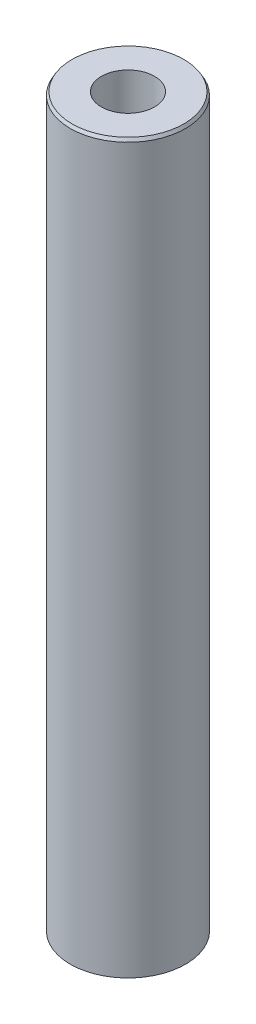
ISO-10303-21;
HEADER;
FILE_DESCRIPTION(('STEP AP214'),'2;1');
FILE_NAME('part.step','',(''),(''),'','','');
FILE_SCHEMA(('AUTOMOTIVE_DESIGN { 1 0 10303 214 1 1 1 1 }'));
ENDSEC;
DATA;
#1=APPLICATION_CONTEXT('core data for automotive mechanical design processes');
#2=APPLICATION_PROTOCOL_DEFINITION('international standard','automotive_design',2000,#1);
#3=PRODUCT_CONTEXT('',#1,'mechanical');
#4=PRODUCT('Part','Part','',(#3));
#5=PRODUCT_RELATED_PRODUCT_CATEGORY('part','',(#4));
#6=PRODUCT_DEFINITION_FORMATION('','',#4);
#7=PRODUCT_DEFINITION_CONTEXT('part definition',#1,'design');
#8=PRODUCT_DEFINITION('design','',#6,#7);
#9=PRODUCT_DEFINITION_SHAPE('','',#8);
#10=(LENGTH_UNIT() NAMED_UNIT(*) SI_UNIT(.MILLI.,.METRE.));
#11=(NAMED_UNIT(*) PLANE_ANGLE_UNIT() SI_UNIT($,.RADIAN.));
#12=(NAMED_UNIT(*) SI_UNIT($,.STERADIAN.) SOLID_ANGLE_UNIT());
#13=UNCERTAINTY_MEASURE_WITH_UNIT(LENGTH_MEASURE(1.E-05),#10,'distance_accuracy_value','');
#14=(GEOMETRIC_REPRESENTATION_CONTEXT(3) GLOBAL_UNCERTAINTY_ASSIGNED_CONTEXT((#13)) GLOBAL_UNIT_ASSIGNED_CONTEXT((#10,
#11,#12)) REPRESENTATION_CONTEXT('',''));
#15=CARTESIAN_POINT('',(0.,0.,0.));
#16=DIRECTION('',(0.,0.,1.));
#17=DIRECTION('',(1.,0.,0.));
#18=AXIS2_PLACEMENT_3D('',#15,#16,#17);
#19=CARTESIAN_POINT('',(0.,600.,0.));
#20=DIRECTION('',(0.,-1.,0.));
#21=DIRECTION('',(0.,0.,-1.));
#22=AXIS2_PLACEMENT_3D('',#19,#20,#21);
#23=CYLINDRICAL_SURFACE('',#22,47.5);
#24=CARTESIAN_POINT('',(0.,597.453538478909,0.));
#25=DIRECTION('',(0.,1.,0.));
#26=DIRECTION('',(0.,0.,1.));
#27=AXIS2_PLACEMENT_3D('',#24,#25,#26);
#28=CIRCLE('',#27,47.5);
#29=CARTESIAN_POINT('',(0.,597.453538478909,47.5));
#30=VERTEX_POINT('',#29);
#31=EDGE_CURVE('E50',#30,#30,#28,.F.);
#32=ORIENTED_EDGE('',*,*,#31,.T.);
#33=EDGE_LOOP('',(#32));
#34=FACE_BOUND('',#33,.T.);
#35=CARTESIAN_POINT('',(0.,1.4702002446827,0.));
#36=DIRECTION('',(0.,1.,0.));
#37=DIRECTION('',(0.,0.,1.));
#38=AXIS2_PLACEMENT_3D('',#35,#36,#37);
#39=CIRCLE('',#38,47.5);
#40=CARTESIAN_POINT('',(0.,1.4702002446827,47.5));
#41=VERTEX_POINT('',#40);
#42=EDGE_CURVE('E51',#41,#41,#39,.T.);
#43=ORIENTED_EDGE('',*,*,#42,.T.);
#44=EDGE_LOOP('',(#43));
#45=FACE_BOUND('',#44,.T.);
#46=ADVANCED_FACE('F39',(#34,#45),#23,.T.);
#47=CARTESIAN_POINT('',(0.,600.,0.));
#48=DIRECTION('',(0.,1.,0.));
#49=DIRECTION('',(0.,0.,1.));
#50=AXIS2_PLACEMENT_3D('',#47,#48,#49);
#51=PLANE('',#50);
#52=CARTESIAN_POINT('',(0.,600.,0.));
#53=DIRECTION('',(0.,1.,0.));
#54=DIRECTION('',(0.,0.,1.));
#55=AXIS2_PLACEMENT_3D('',#52,#53,#54);
#56=CIRCLE('',#55,46.0297997553173);
#57=CARTESIAN_POINT('',(0.,600.,46.0297997553173));
#58=VERTEX_POINT('',#57);
#59=EDGE_CURVE('E54',#58,#58,#56,.T.);
#60=ORIENTED_EDGE('',*,*,#59,.T.);
#61=EDGE_LOOP('',(#60));
#62=FACE_BOUND('',#61,.T.);
#63=CARTESIAN_POINT('',(0.,600.,0.));
#64=DIRECTION('',(0.,1.,0.));
#65=DIRECTION('',(0.,0.,1.));
#66=AXIS2_PLACEMENT_3D('',#63,#64,#65);
#67=CIRCLE('',#66,21.8825817079595);
#68=CARTESIAN_POINT('',(0.,600.,21.8825817079595));
#69=VERTEX_POINT('',#68);
#70=EDGE_CURVE('E58',#69,#69,#67,.T.);
#71=ORIENTED_EDGE('',*,*,#70,.F.);
#72=EDGE_LOOP('',(#71));
#73=FACE_BOUND('',#72,.T.);
#74=ADVANCED_FACE('F69',(#62,#73),#51,.T.);
#75=CARTESIAN_POINT('',(0.,0.,0.));
#76=DIRECTION('',(0.,1.,0.));
#77=DIRECTION('',(0.,0.,1.));
#78=AXIS2_PLACEMENT_3D('',#75,#76,#77);
#79=PLANE('',#78);
#80=CARTESIAN_POINT('',(0.,0.,0.));
#81=DIRECTION('',(0.,1.,0.));
#82=DIRECTION('',(0.,0.,1.));
#83=AXIS2_PLACEMENT_3D('',#80,#81,#82);
#84=CIRCLE('',#83,44.9535384789095);
#85=CARTESIAN_POINT('',(0.,0.,44.9535384789095));
#86=VERTEX_POINT('',#85);
#87=EDGE_CURVE('E10',#86,#86,#84,.F.);
#88=ORIENTED_EDGE('',*,*,#87,.T.);
#89=EDGE_LOOP('',(#88));
#90=FACE_BOUND('',#89,.T.);
#91=CARTESIAN_POINT('',(0.,0.,0.));
#92=DIRECTION('',(0.,1.,0.));
#93=DIRECTION('',(0.,0.,1.));
#94=AXIS2_PLACEMENT_3D('',#91,#92,#93);
#95=CIRCLE('',#94,21.8825817079595);
#96=CARTESIAN_POINT('',(0.,0.,21.8825817079595));
#97=VERTEX_POINT('',#96);
#98=EDGE_CURVE('E63',#97,#97,#95,.T.);
#99=ORIENTED_EDGE('',*,*,#98,.T.);
#100=EDGE_LOOP('',(#99));
#101=FACE_BOUND('',#100,.T.);
#102=ADVANCED_FACE('F75',(#90,#101),#79,.F.);
#103=CARTESIAN_POINT('',(0.,600.,0.));
#104=DIRECTION('',(0.,-1.,0.));
#105=DIRECTION('',(0.,0.,-1.));
#106=AXIS2_PLACEMENT_3D('',#103,#104,#105);
#107=CYLINDRICAL_SURFACE('',#106,21.8825817079595);
#108=ORIENTED_EDGE('',*,*,#70,.T.);
#109=EDGE_LOOP('',(#108));
#110=FACE_BOUND('',#109,.T.);
#111=ORIENTED_EDGE('',*,*,#98,.F.);
#112=EDGE_LOOP('',(#111));
#113=FACE_BOUND('',#112,.T.);
#114=ADVANCED_FACE('F70',(#110,#113),#107,.F.);
#115=CARTESIAN_POINT('',(0.,600.,0.));
#116=DIRECTION('',(0.,-1.,0.));
#117=DIRECTION('',(0.,0.,-1.));
#118=AXIS2_PLACEMENT_3D('',#115,#116,#117);
#119=CONICAL_SURFACE('',#118,46.0297997553173,0.52359877559829);
#120=ORIENTED_EDGE('',*,*,#31,.F.);
#121=EDGE_LOOP('',(#120));
#122=FACE_BOUND('',#121,.T.);
#123=ORIENTED_EDGE('',*,*,#59,.F.);
#124=EDGE_LOOP('',(#123));
#125=FACE_BOUND('',#124,.T.);
#126=ADVANCED_FACE('F81',(#122,#125),#119,.T.);
#127=CARTESIAN_POINT('',(0.,1.4702002446827,0.));
#128=DIRECTION('',(0.,1.,0.));
#129=DIRECTION('',(0.,0.,1.));
#130=AXIS2_PLACEMENT_3D('',#127,#128,#129);
#131=CONICAL_SURFACE('',#130,47.5,1.04719755119658);
#132=ORIENTED_EDGE('',*,*,#87,.F.);
#133=EDGE_LOOP('',(#132));
#134=FACE_BOUND('',#133,.T.);
#135=ORIENTED_EDGE('',*,*,#42,.F.);
#136=EDGE_LOOP('',(#135));
#137=FACE_BOUND('',#136,.T.);
#138=ADVANCED_FACE('F45',(#134,#137),#131,.T.);
#139=CLOSED_SHELL('',(#46,#74,#102,#114,#126,#138));
#140=MANIFOLD_SOLID_BREP('B2',#139);
#141=ADVANCED_BREP_SHAPE_REPRESENTATION('',(#18,#140),#14);
#142=SHAPE_DEFINITION_REPRESENTATION(#9,#141);
ENDSEC;
END-ISO-10303-21;
